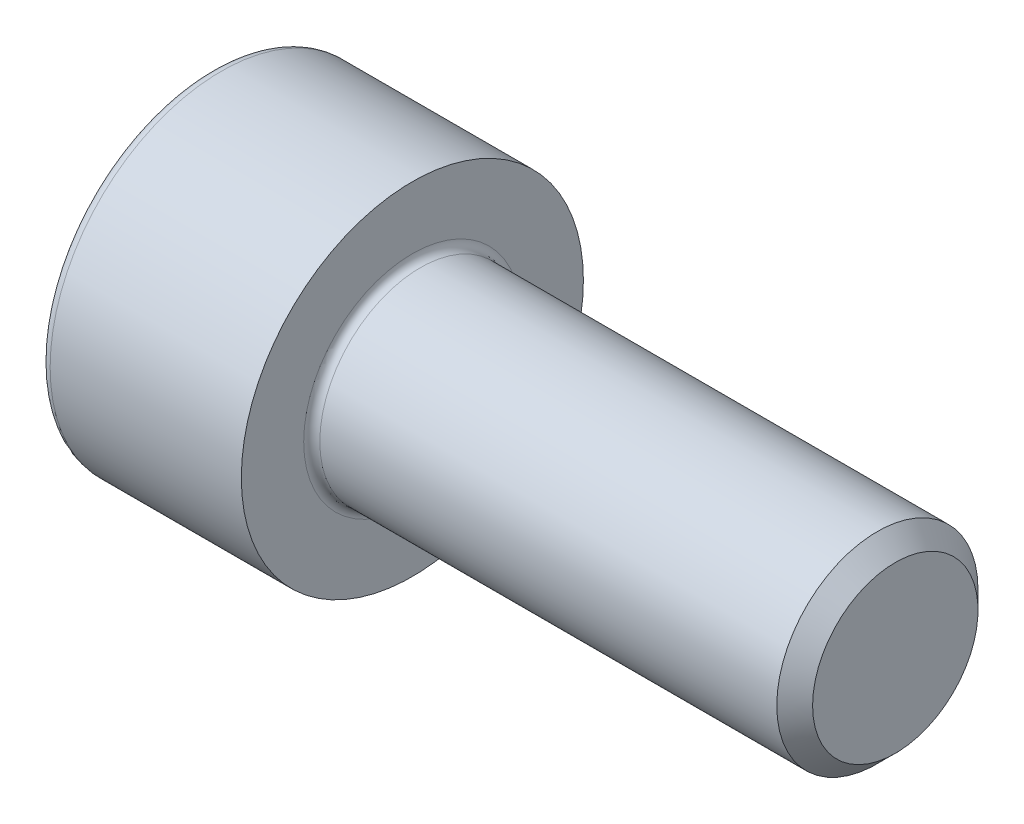
ISO-10303-21;
HEADER;
FILE_DESCRIPTION(('STEP AP214'),'2;1');
FILE_NAME('part.step','',(''),(''),'','','');
FILE_SCHEMA(('AUTOMOTIVE_DESIGN { 1 0 10303 214 1 1 1 1 }'));
ENDSEC;
DATA;
#1=APPLICATION_CONTEXT('core data for automotive mechanical design processes');
#2=APPLICATION_PROTOCOL_DEFINITION('international standard','automotive_design',2000,#1);
#3=PRODUCT_CONTEXT('',#1,'mechanical');
#4=PRODUCT('Part','Part','',(#3));
#5=PRODUCT_RELATED_PRODUCT_CATEGORY('part','',(#4));
#6=PRODUCT_DEFINITION_FORMATION('','',#4);
#7=PRODUCT_DEFINITION_CONTEXT('part definition',#1,'design');
#8=PRODUCT_DEFINITION('design','',#6,#7);
#9=PRODUCT_DEFINITION_SHAPE('','',#8);
#10=(LENGTH_UNIT() NAMED_UNIT(*) SI_UNIT(.MILLI.,.METRE.));
#11=(NAMED_UNIT(*) PLANE_ANGLE_UNIT() SI_UNIT($,.RADIAN.));
#12=(NAMED_UNIT(*) SI_UNIT($,.STERADIAN.) SOLID_ANGLE_UNIT());
#13=UNCERTAINTY_MEASURE_WITH_UNIT(LENGTH_MEASURE(1.E-05),#10,'distance_accuracy_value','');
#14=(GEOMETRIC_REPRESENTATION_CONTEXT(3) GLOBAL_UNCERTAINTY_ASSIGNED_CONTEXT((#13)) GLOBAL_UNIT_ASSIGNED_CONTEXT((#10,
#11,#12)) REPRESENTATION_CONTEXT('',''));
#15=CARTESIAN_POINT('',(0.,0.,0.));
#16=DIRECTION('',(0.,0.,1.));
#17=DIRECTION('',(1.,0.,0.));
#18=AXIS2_PLACEMENT_3D('',#15,#16,#17);
#19=CARTESIAN_POINT('',(0.,0.,0.));
#20=DIRECTION('',(-1.,0.,0.));
#21=DIRECTION('',(0.,0.,1.));
#22=AXIS2_PLACEMENT_3D('',#19,#20,#21);
#23=PLANE('',#22);
#24=DIRECTION('',(0.,-0.499999999999999,0.866025403784439));
#25=VECTOR('',#24,1.);
#26=CARTESIAN_POINT('',(0.,2.35789849937043,0.));
#27=LINE('',#26,#25);
#28=CARTESIAN_POINT('',(0.,2.35789849937043,0.));
#29=VERTEX_POINT('',#28);
#30=CARTESIAN_POINT('',(0.,1.17894924968522,2.042));
#31=VERTEX_POINT('',#30);
#32=EDGE_CURVE('E261',#29,#31,#27,.T.);
#33=ORIENTED_EDGE('',*,*,#32,.T.);
#34=DIRECTION('',(0.,1.,0.));
#35=VECTOR('',#34,1.);
#36=CARTESIAN_POINT('',(0.,-1.17894924968522,2.042));
#37=LINE('',#36,#35);
#38=CARTESIAN_POINT('',(0.,-1.17894924968522,2.042));
#39=VERTEX_POINT('',#38);
#40=EDGE_CURVE('E122',#39,#31,#37,.T.);
#41=ORIENTED_EDGE('',*,*,#40,.F.);
#42=DIRECTION('',(0.,-0.500000000000001,-0.866025403784438));
#43=VECTOR('',#42,1.);
#44=CARTESIAN_POINT('',(0.,-1.17894924968522,2.042));
#45=LINE('',#44,#43);
#46=CARTESIAN_POINT('',(0.,-2.35789849937043,0.));
#47=VERTEX_POINT('',#46);
#48=EDGE_CURVE('E264',#39,#47,#45,.T.);
#49=ORIENTED_EDGE('',*,*,#48,.T.);
#50=DIRECTION('',(0.,0.499999999999999,-0.866025403784439));
#51=VECTOR('',#50,1.);
#52=CARTESIAN_POINT('',(0.,-2.35789849937043,0.));
#53=LINE('',#52,#51);
#54=CARTESIAN_POINT('',(0.,-1.17894924968522,-2.042));
#55=VERTEX_POINT('',#54);
#56=EDGE_CURVE('E267',#47,#55,#53,.T.);
#57=ORIENTED_EDGE('',*,*,#56,.T.);
#58=DIRECTION('',(0.,-1.,0.));
#59=VECTOR('',#58,1.);
#60=CARTESIAN_POINT('',(0.,1.17894924968521,-2.042));
#61=LINE('',#60,#59);
#62=CARTESIAN_POINT('',(0.,1.17894924968521,-2.042));
#63=VERTEX_POINT('',#62);
#64=EDGE_CURVE('E270',#63,#55,#61,.T.);
#65=ORIENTED_EDGE('',*,*,#64,.F.);
#66=DIRECTION('',(0.,-0.500000000000001,-0.866025403784438));
#67=VECTOR('',#66,1.);
#68=CARTESIAN_POINT('',(0.,2.35789849937043,0.));
#69=LINE('',#68,#67);
#70=EDGE_CURVE('E117',#29,#63,#69,.T.);
#71=ORIENTED_EDGE('',*,*,#70,.F.);
#72=EDGE_LOOP('',(#33,#41,#49,#57,#65,#71));
#73=FACE_BOUND('',#72,.T.);
#74=CARTESIAN_POINT('',(0.,0.,0.));
#75=DIRECTION('',(-1.,0.,0.));
#76=DIRECTION('',(0.,0.,1.));
#77=AXIS2_PLACEMENT_3D('',#74,#75,#76);
#78=CIRCLE('',#77,4.);
#79=CARTESIAN_POINT('',(0.,0.,4.));
#80=VERTEX_POINT('',#79);
#81=EDGE_CURVE('E38',#80,#80,#78,.T.);
#82=ORIENTED_EDGE('',*,*,#81,.T.);
#83=EDGE_LOOP('',(#82));
#84=FACE_BOUND('',#83,.T.);
#85=ADVANCED_FACE('F30',(#73,#84),#23,.T.);
#86=CARTESIAN_POINT('',(-31.75,0.,0.));
#87=DIRECTION('',(-1.,0.,0.));
#88=DIRECTION('',(0.,0.,1.));
#89=AXIS2_PLACEMENT_3D('',#86,#87,#88);
#90=CYLINDRICAL_SURFACE('',#89,4.25);
#91=CARTESIAN_POINT('',(0.25,0.,0.));
#92=DIRECTION('',(-1.,0.,0.));
#93=DIRECTION('',(0.,0.,1.));
#94=AXIS2_PLACEMENT_3D('',#91,#92,#93);
#95=CIRCLE('',#94,4.25);
#96=CARTESIAN_POINT('',(0.25,0.,4.25));
#97=VERTEX_POINT('',#96);
#98=EDGE_CURVE('E11',#97,#97,#95,.F.);
#99=ORIENTED_EDGE('',*,*,#98,.T.);
#100=EDGE_LOOP('',(#99));
#101=FACE_BOUND('',#100,.T.);
#102=CARTESIAN_POINT('',(5.,0.,0.));
#103=DIRECTION('',(-1.,0.,0.));
#104=DIRECTION('',(0.,0.,1.));
#105=AXIS2_PLACEMENT_3D('',#102,#103,#104);
#106=CIRCLE('',#105,4.25);
#107=CARTESIAN_POINT('',(5.,0.,4.25));
#108=VERTEX_POINT('',#107);
#109=EDGE_CURVE('E140',#108,#108,#106,.T.);
#110=ORIENTED_EDGE('',*,*,#109,.T.);
#111=EDGE_LOOP('',(#110));
#112=FACE_BOUND('',#111,.T.);
#113=ADVANCED_FACE('F164',(#101,#112),#90,.T.);
#114=CARTESIAN_POINT('',(5.,4.25,0.));
#115=DIRECTION('',(1.,0.,0.));
#116=DIRECTION('',(0.,0.,-1.));
#117=AXIS2_PLACEMENT_3D('',#114,#115,#116);
#118=PLANE('',#117);
#119=CARTESIAN_POINT('',(5.,0.,0.));
#120=DIRECTION('',(1.,0.,0.));
#121=DIRECTION('',(0.,0.,-1.));
#122=AXIS2_PLACEMENT_3D('',#119,#120,#121);
#123=CIRCLE('',#122,2.7);
#124=CARTESIAN_POINT('',(5.,0.,-2.7));
#125=VERTEX_POINT('',#124);
#126=EDGE_CURVE('E143',#125,#125,#123,.F.);
#127=ORIENTED_EDGE('',*,*,#126,.T.);
#128=EDGE_LOOP('',(#127));
#129=FACE_BOUND('',#128,.T.);
#130=ORIENTED_EDGE('',*,*,#109,.F.);
#131=EDGE_LOOP('',(#130));
#132=FACE_BOUND('',#131,.T.);
#133=ADVANCED_FACE('F170',(#129,#132),#118,.T.);
#134=CARTESIAN_POINT('',(-31.75,0.,0.));
#135=DIRECTION('',(-1.,0.,0.));
#136=DIRECTION('',(0.,0.,1.));
#137=AXIS2_PLACEMENT_3D('',#134,#135,#136);
#138=CYLINDRICAL_SURFACE('',#137,2.5);
#139=CARTESIAN_POINT('',(5.2,0.,0.));
#140=DIRECTION('',(1.,0.,0.));
#141=DIRECTION('',(0.,0.,-1.));
#142=AXIS2_PLACEMENT_3D('',#139,#140,#141);
#143=CIRCLE('',#142,2.5);
#144=CARTESIAN_POINT('',(5.2,0.,-2.5));
#145=VERTEX_POINT('',#144);
#146=EDGE_CURVE('E146',#145,#145,#143,.T.);
#147=ORIENTED_EDGE('',*,*,#146,.T.);
#148=EDGE_LOOP('',(#147));
#149=FACE_BOUND('',#148,.T.);
#150=CARTESIAN_POINT('',(16.555,0.,0.));
#151=DIRECTION('',(-1.,0.,0.));
#152=DIRECTION('',(0.,0.,1.));
#153=AXIS2_PLACEMENT_3D('',#150,#151,#152);
#154=CIRCLE('',#153,2.5);
#155=CARTESIAN_POINT('',(16.555,0.,2.5));
#156=VERTEX_POINT('',#155);
#157=EDGE_CURVE('E137',#156,#156,#154,.T.);
#158=ORIENTED_EDGE('',*,*,#157,.T.);
#159=EDGE_LOOP('',(#158));
#160=FACE_BOUND('',#159,.T.);
#161=ADVANCED_FACE('F176',(#149,#160),#138,.T.);
#162=CARTESIAN_POINT('',(17.,0.,0.));
#163=DIRECTION('',(-1.,0.,0.));
#164=DIRECTION('',(0.,0.,1.));
#165=AXIS2_PLACEMENT_3D('',#162,#163,#164);
#166=CONICAL_SURFACE('',#165,2.055,0.785398163397464);
#167=ORIENTED_EDGE('',*,*,#157,.F.);
#168=EDGE_LOOP('',(#167));
#169=FACE_BOUND('',#168,.T.);
#170=CARTESIAN_POINT('',(17.,0.,0.));
#171=DIRECTION('',(-1.,0.,0.));
#172=DIRECTION('',(0.,0.,1.));
#173=AXIS2_PLACEMENT_3D('',#170,#171,#172);
#174=CIRCLE('',#173,2.055);
#175=CARTESIAN_POINT('',(17.,0.,2.055));
#176=VERTEX_POINT('',#175);
#177=EDGE_CURVE('E133',#176,#176,#174,.T.);
#178=ORIENTED_EDGE('',*,*,#177,.T.);
#179=EDGE_LOOP('',(#178));
#180=FACE_BOUND('',#179,.T.);
#181=ADVANCED_FACE('F180',(#169,#180),#166,.T.);
#182=CARTESIAN_POINT('',(17.,2.055,0.));
#183=DIRECTION('',(1.,0.,0.));
#184=DIRECTION('',(0.,0.,-1.));
#185=AXIS2_PLACEMENT_3D('',#182,#183,#184);
#186=PLANE('',#185);
#187=ORIENTED_EDGE('',*,*,#177,.F.);
#188=EDGE_LOOP('',(#187));
#189=FACE_BOUND('',#188,.T.);
#190=ADVANCED_FACE('F160',(#189),#186,.T.);
#191=CARTESIAN_POINT('',(5.2,0.,0.));
#192=DIRECTION('',(1.,0.,0.));
#193=DIRECTION('',(0.,0.,-1.));
#194=AXIS2_PLACEMENT_3D('',#191,#192,#193);
#195=TOROIDAL_SURFACE('',#194,2.7,0.2);
#196=ORIENTED_EDGE('',*,*,#146,.F.);
#197=EDGE_LOOP('',(#196));
#198=FACE_BOUND('',#197,.T.);
#199=ORIENTED_EDGE('',*,*,#126,.F.);
#200=EDGE_LOOP('',(#199));
#201=FACE_BOUND('',#200,.T.);
#202=ADVANCED_FACE('F153',(#198,#201),#195,.F.);
#203=CARTESIAN_POINT('',(0.25,0.,0.));
#204=DIRECTION('',(-1.,0.,0.));
#205=DIRECTION('',(0.,0.,1.));
#206=AXIS2_PLACEMENT_3D('',#203,#204,#205);
#207=TOROIDAL_SURFACE('',#206,4.,0.25);
#208=ORIENTED_EDGE('',*,*,#98,.F.);
#209=EDGE_LOOP('',(#208));
#210=FACE_BOUND('',#209,.T.);
#211=ORIENTED_EDGE('',*,*,#81,.F.);
#212=EDGE_LOOP('',(#211));
#213=FACE_BOUND('',#212,.T.);
#214=ADVANCED_FACE('F32',(#210,#213),#207,.T.);
#215=CARTESIAN_POINT('',(2.5,2.35789849937043,0.));
#216=DIRECTION('',(0.,-0.866025403784439,-0.499999999999999));
#217=DIRECTION('',(0.,0.499999999999999,-0.866025403784439));
#218=AXIS2_PLACEMENT_3D('',#215,#216,#217);
#219=PLANE('',#218);
#220=ORIENTED_EDGE('',*,*,#32,.F.);
#221=DIRECTION('',(-1.,0.,0.));
#222=VECTOR('',#221,1.);
#223=CARTESIAN_POINT('',(2.5,2.35789849937043,0.));
#224=LINE('',#223,#222);
#225=CARTESIAN_POINT('',(2.5,2.35789849937043,0.));
#226=VERTEX_POINT('',#225);
#227=EDGE_CURVE('E260',#226,#29,#224,.T.);
#228=ORIENTED_EDGE('',*,*,#227,.F.);
#229=DIRECTION('',(0.,-0.499999999999999,0.866025403784439));
#230=VECTOR('',#229,1.);
#231=CARTESIAN_POINT('',(2.5,2.35789849937043,0.));
#232=LINE('',#231,#230);
#233=CARTESIAN_POINT('',(2.5,1.76842387452783,1.021));
#234=VERTEX_POINT('',#233);
#235=EDGE_CURVE('E45',#226,#234,#232,.T.);
#236=ORIENTED_EDGE('',*,*,#235,.T.);
#237=CARTESIAN_POINT('',(2.5,1.17894924968522,2.042));
#238=VERTEX_POINT('',#237);
#239=EDGE_CURVE('E103',#234,#238,#232,.T.);
#240=ORIENTED_EDGE('',*,*,#239,.T.);
#241=DIRECTION('',(-1.,0.,0.));
#242=VECTOR('',#241,1.);
#243=CARTESIAN_POINT('',(2.5,1.17894924968522,2.042));
#244=LINE('',#243,#242);
#245=EDGE_CURVE('E115',#238,#31,#244,.T.);
#246=ORIENTED_EDGE('',*,*,#245,.T.);
#247=EDGE_LOOP('',(#220,#228,#236,#240,#246));
#248=FACE_BOUND('',#247,.T.);
#249=ADVANCED_FACE('F114',(#248),#219,.T.);
#250=CARTESIAN_POINT('',(2.5,-1.17894924968522,2.042));
#251=DIRECTION('',(0.,0.,1.));
#252=DIRECTION('',(0.,-1.,0.));
#253=AXIS2_PLACEMENT_3D('',#250,#251,#252);
#254=PLANE('',#253);
#255=ORIENTED_EDGE('',*,*,#40,.T.);
#256=ORIENTED_EDGE('',*,*,#245,.F.);
#257=DIRECTION('',(0.,1.,0.));
#258=VECTOR('',#257,1.);
#259=CARTESIAN_POINT('',(2.5,-1.17894924968522,2.042));
#260=LINE('',#259,#258);
#261=CARTESIAN_POINT('',(2.5,0.,2.042));
#262=VERTEX_POINT('',#261);
#263=EDGE_CURVE('E101',#262,#238,#260,.T.);
#264=ORIENTED_EDGE('',*,*,#263,.F.);
#265=CARTESIAN_POINT('',(2.5,-1.17894924968522,2.042));
#266=VERTEX_POINT('',#265);
#267=EDGE_CURVE('E111',#266,#262,#260,.T.);
#268=ORIENTED_EDGE('',*,*,#267,.F.);
#269=DIRECTION('',(-1.,0.,0.));
#270=VECTOR('',#269,1.);
#271=CARTESIAN_POINT('',(2.5,-1.17894924968522,2.042));
#272=LINE('',#271,#270);
#273=EDGE_CURVE('E124',#266,#39,#272,.T.);
#274=ORIENTED_EDGE('',*,*,#273,.T.);
#275=EDGE_LOOP('',(#255,#256,#264,#268,#274));
#276=FACE_BOUND('',#275,.T.);
#277=ADVANCED_FACE('F119',(#276),#254,.F.);
#278=CARTESIAN_POINT('',(2.5,-1.17894924968522,2.042));
#279=DIRECTION('',(0.,0.866025403784438,-0.500000000000001));
#280=DIRECTION('',(0.,0.500000000000001,0.866025403784438));
#281=AXIS2_PLACEMENT_3D('',#278,#279,#280);
#282=PLANE('',#281);
#283=ORIENTED_EDGE('',*,*,#48,.F.);
#284=ORIENTED_EDGE('',*,*,#273,.F.);
#285=DIRECTION('',(0.,-0.500000000000001,-0.866025403784438));
#286=VECTOR('',#285,1.);
#287=CARTESIAN_POINT('',(2.5,-1.17894924968522,2.042));
#288=LINE('',#287,#286);
#289=CARTESIAN_POINT('',(2.5,-1.76842387452782,1.021));
#290=VERTEX_POINT('',#289);
#291=EDGE_CURVE('E241',#266,#290,#288,.T.);
#292=ORIENTED_EDGE('',*,*,#291,.T.);
#293=CARTESIAN_POINT('',(2.5,-2.35789849937043,0.));
#294=VERTEX_POINT('',#293);
#295=EDGE_CURVE('E243',#290,#294,#288,.T.);
#296=ORIENTED_EDGE('',*,*,#295,.T.);
#297=DIRECTION('',(-1.,0.,0.));
#298=VECTOR('',#297,1.);
#299=CARTESIAN_POINT('',(2.5,-2.35789849937043,0.));
#300=LINE('',#299,#298);
#301=EDGE_CURVE('E129',#294,#47,#300,.T.);
#302=ORIENTED_EDGE('',*,*,#301,.T.);
#303=EDGE_LOOP('',(#283,#284,#292,#296,#302));
#304=FACE_BOUND('',#303,.T.);
#305=ADVANCED_FACE('F193',(#304),#282,.T.);
#306=CARTESIAN_POINT('',(2.5,-2.35789849937043,0.));
#307=DIRECTION('',(0.,0.866025403784439,0.499999999999999));
#308=DIRECTION('',(0.,-0.499999999999999,0.86602540378444));
#309=AXIS2_PLACEMENT_3D('',#306,#307,#308);
#310=PLANE('',#309);
#311=ORIENTED_EDGE('',*,*,#56,.F.);
#312=ORIENTED_EDGE('',*,*,#301,.F.);
#313=DIRECTION('',(0.,0.499999999999999,-0.866025403784439));
#314=VECTOR('',#313,1.);
#315=CARTESIAN_POINT('',(2.5,-2.35789849937043,0.));
#316=LINE('',#315,#314);
#317=CARTESIAN_POINT('',(2.5,-1.76842387452783,-1.021));
#318=VERTEX_POINT('',#317);
#319=EDGE_CURVE('E246',#294,#318,#316,.T.);
#320=ORIENTED_EDGE('',*,*,#319,.T.);
#321=CARTESIAN_POINT('',(2.5,-1.17894924968522,-2.042));
#322=VERTEX_POINT('',#321);
#323=EDGE_CURVE('E250',#318,#322,#316,.T.);
#324=ORIENTED_EDGE('',*,*,#323,.T.);
#325=DIRECTION('',(-1.,0.,0.));
#326=VECTOR('',#325,1.);
#327=CARTESIAN_POINT('',(2.5,-1.17894924968522,-2.042));
#328=LINE('',#327,#326);
#329=EDGE_CURVE('E279',#322,#55,#328,.T.);
#330=ORIENTED_EDGE('',*,*,#329,.T.);
#331=EDGE_LOOP('',(#311,#312,#320,#324,#330));
#332=FACE_BOUND('',#331,.T.);
#333=ADVANCED_FACE('F196',(#332),#310,.T.);
#334=CARTESIAN_POINT('',(2.5,1.17894924968521,-2.042));
#335=DIRECTION('',(0.,0.,-1.));
#336=DIRECTION('',(0.,1.,0.));
#337=AXIS2_PLACEMENT_3D('',#334,#335,#336);
#338=PLANE('',#337);
#339=ORIENTED_EDGE('',*,*,#64,.T.);
#340=ORIENTED_EDGE('',*,*,#329,.F.);
#341=DIRECTION('',(0.,-1.,0.));
#342=VECTOR('',#341,1.);
#343=CARTESIAN_POINT('',(2.5,1.17894924968521,-2.042));
#344=LINE('',#343,#342);
#345=CARTESIAN_POINT('',(2.5,0.,-2.042));
#346=VERTEX_POINT('',#345);
#347=EDGE_CURVE('E254',#346,#322,#344,.T.);
#348=ORIENTED_EDGE('',*,*,#347,.F.);
#349=CARTESIAN_POINT('',(2.5,1.17894924968521,-2.042));
#350=VERTEX_POINT('',#349);
#351=EDGE_CURVE('E255',#350,#346,#344,.T.);
#352=ORIENTED_EDGE('',*,*,#351,.F.);
#353=DIRECTION('',(-1.,0.,0.));
#354=VECTOR('',#353,1.);
#355=CARTESIAN_POINT('',(2.5,1.17894924968521,-2.042));
#356=LINE('',#355,#354);
#357=EDGE_CURVE('E276',#350,#63,#356,.T.);
#358=ORIENTED_EDGE('',*,*,#357,.T.);
#359=EDGE_LOOP('',(#339,#340,#348,#352,#358));
#360=FACE_BOUND('',#359,.T.);
#361=ADVANCED_FACE('F200',(#360),#338,.F.);
#362=CARTESIAN_POINT('',(2.5,2.35789849937043,0.));
#363=DIRECTION('',(0.,0.866025403784438,-0.500000000000001));
#364=DIRECTION('',(0.,0.500000000000001,0.866025403784438));
#365=AXIS2_PLACEMENT_3D('',#362,#363,#364);
#366=PLANE('',#365);
#367=ORIENTED_EDGE('',*,*,#70,.T.);
#368=ORIENTED_EDGE('',*,*,#357,.F.);
#369=DIRECTION('',(0.,-0.500000000000001,-0.866025403784438));
#370=VECTOR('',#369,1.);
#371=CARTESIAN_POINT('',(2.5,2.35789849937043,0.));
#372=LINE('',#371,#370);
#373=CARTESIAN_POINT('',(2.5,1.76842387452782,-1.021));
#374=VERTEX_POINT('',#373);
#375=EDGE_CURVE('E258',#374,#350,#372,.T.);
#376=ORIENTED_EDGE('',*,*,#375,.F.);
#377=EDGE_CURVE('E232',#226,#374,#372,.T.);
#378=ORIENTED_EDGE('',*,*,#377,.F.);
#379=ORIENTED_EDGE('',*,*,#227,.T.);
#380=EDGE_LOOP('',(#367,#368,#376,#378,#379));
#381=FACE_BOUND('',#380,.T.);
#382=ADVANCED_FACE('F204',(#381),#366,.F.);
#383=CARTESIAN_POINT('',(2.5,1.17894924968522,2.042));
#384=DIRECTION('',(-1.,0.,0.));
#385=DIRECTION('',(0.,0.,1.));
#386=AXIS2_PLACEMENT_3D('',#383,#384,#385);
#387=PLANE('',#386);
#388=CARTESIAN_POINT('',(2.5,0.,0.));
#389=DIRECTION('',(-1.,0.,0.));
#390=DIRECTION('',(0.,0.,1.));
#391=AXIS2_PLACEMENT_3D('',#388,#389,#390);
#392=CIRCLE('',#391,2.042);
#393=EDGE_CURVE('E123',#290,#262,#392,.T.);
#394=ORIENTED_EDGE('',*,*,#393,.F.);
#395=ORIENTED_EDGE('',*,*,#291,.F.);
#396=ORIENTED_EDGE('',*,*,#267,.T.);
#397=EDGE_LOOP('',(#394,#395,#396));
#398=FACE_BOUND('',#397,.T.);
#399=ADVANCED_FACE('F208',(#398),#387,.T.);
#400=EDGE_CURVE('E127',#318,#290,#392,.T.);
#401=ORIENTED_EDGE('',*,*,#400,.F.);
#402=ORIENTED_EDGE('',*,*,#319,.F.);
#403=ORIENTED_EDGE('',*,*,#295,.F.);
#404=EDGE_LOOP('',(#401,#402,#403));
#405=FACE_BOUND('',#404,.T.);
#406=ADVANCED_FACE('F211',(#405),#387,.T.);
#407=EDGE_CURVE('E285',#346,#318,#392,.T.);
#408=ORIENTED_EDGE('',*,*,#407,.F.);
#409=ORIENTED_EDGE('',*,*,#347,.T.);
#410=ORIENTED_EDGE('',*,*,#323,.F.);
#411=EDGE_LOOP('',(#408,#409,#410));
#412=FACE_BOUND('',#411,.T.);
#413=ADVANCED_FACE('F216',(#412),#387,.T.);
#414=EDGE_CURVE('E235',#374,#346,#392,.T.);
#415=ORIENTED_EDGE('',*,*,#414,.F.);
#416=ORIENTED_EDGE('',*,*,#375,.T.);
#417=ORIENTED_EDGE('',*,*,#351,.T.);
#418=EDGE_LOOP('',(#415,#416,#417));
#419=FACE_BOUND('',#418,.T.);
#420=ADVANCED_FACE('F223',(#419),#387,.T.);
#421=EDGE_CURVE('E134',#234,#374,#392,.T.);
#422=ORIENTED_EDGE('',*,*,#421,.F.);
#423=ORIENTED_EDGE('',*,*,#235,.F.);
#424=ORIENTED_EDGE('',*,*,#377,.T.);
#425=EDGE_LOOP('',(#422,#423,#424));
#426=FACE_BOUND('',#425,.T.);
#427=ADVANCED_FACE('F219',(#426),#387,.T.);
#428=EDGE_CURVE('E106',#262,#234,#392,.T.);
#429=ORIENTED_EDGE('',*,*,#428,.F.);
#430=ORIENTED_EDGE('',*,*,#263,.T.);
#431=ORIENTED_EDGE('',*,*,#239,.F.);
#432=EDGE_LOOP('',(#429,#430,#431));
#433=FACE_BOUND('',#432,.T.);
#434=ADVANCED_FACE('F102',(#433),#387,.T.);
#435=CARTESIAN_POINT('',(2.5,0.,0.));
#436=DIRECTION('',(-1.,0.,0.));
#437=DIRECTION('',(0.,0.,1.));
#438=AXIS2_PLACEMENT_3D('',#435,#436,#437);
#439=CONICAL_SURFACE('',#438,2.042,1.04719755119659);
#440=CARTESIAN_POINT('',(3.67894924968523,0.,0.));
#441=VERTEX_POINT('',#440);
#442=VERTEX_LOOP('',#441);
#443=FACE_BOUND('',#442,.T.);
#444=ORIENTED_EDGE('',*,*,#428,.T.);
#445=ORIENTED_EDGE('',*,*,#421,.T.);
#446=ORIENTED_EDGE('',*,*,#414,.T.);
#447=ORIENTED_EDGE('',*,*,#407,.T.);
#448=ORIENTED_EDGE('',*,*,#400,.T.);
#449=ORIENTED_EDGE('',*,*,#393,.T.);
#450=EDGE_LOOP('',(#444,#445,#446,#447,#448,#449));
#451=FACE_BOUND('',#450,.T.);
#452=ADVANCED_FACE('F188',(#443,#451),#439,.F.);
#453=CLOSED_SHELL('',(#85,#113,#133,#161,#181,#190,#202,#214,#249,#277,#305,#333,#361,#382,#399,
#406,#413,#420,#427,#434,#452));
#454=MANIFOLD_SOLID_BREP('B2',#453);
#455=ADVANCED_BREP_SHAPE_REPRESENTATION('',(#18,#454),#14);
#456=SHAPE_DEFINITION_REPRESENTATION(#9,#455);
ENDSEC;
END-ISO-10303-21;
